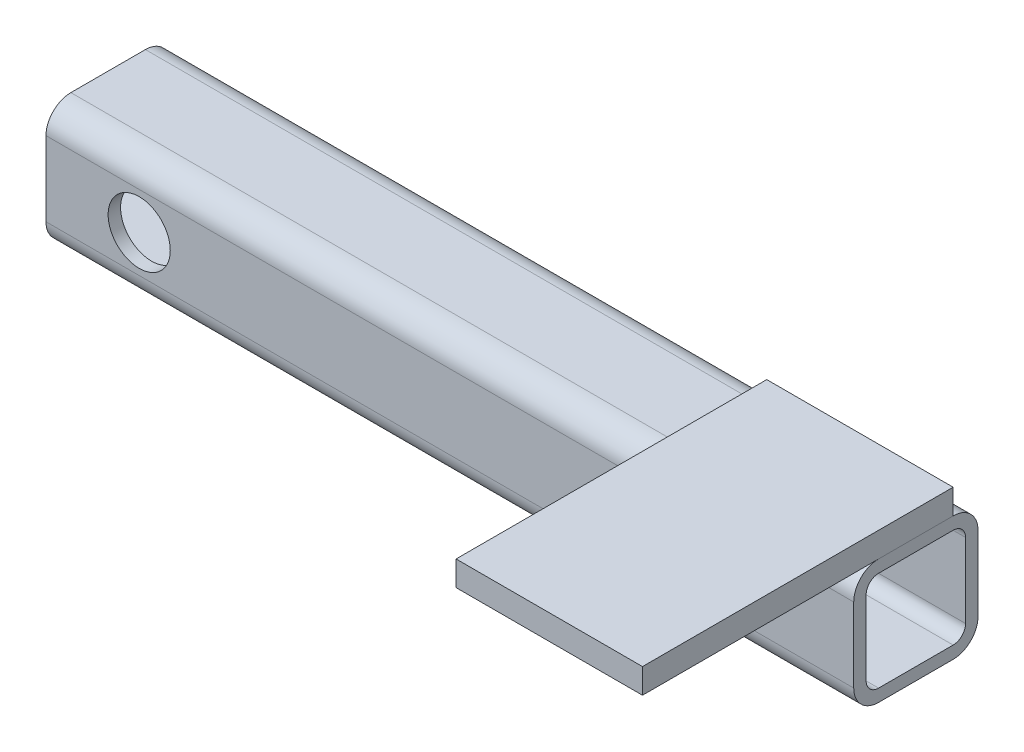
ISO-10303-21;
HEADER;
FILE_DESCRIPTION(('STEP AP214'),'2;1');
FILE_NAME('part.step','',(''),(''),'','','');
FILE_SCHEMA(('AUTOMOTIVE_DESIGN { 1 0 10303 214 1 1 1 1 }'));
ENDSEC;
DATA;
#1=APPLICATION_CONTEXT('core data for automotive mechanical design processes');
#2=APPLICATION_PROTOCOL_DEFINITION('international standard','automotive_design',2000,#1);
#3=PRODUCT_CONTEXT('',#1,'mechanical');
#4=PRODUCT('Part','Part','',(#3));
#5=PRODUCT_RELATED_PRODUCT_CATEGORY('part','',(#4));
#6=PRODUCT_DEFINITION_FORMATION('','',#4);
#7=PRODUCT_DEFINITION_CONTEXT('part definition',#1,'design');
#8=PRODUCT_DEFINITION('design','',#6,#7);
#9=PRODUCT_DEFINITION_SHAPE('','',#8);
#10=(LENGTH_UNIT() NAMED_UNIT(*) SI_UNIT(.MILLI.,.METRE.));
#11=(NAMED_UNIT(*) PLANE_ANGLE_UNIT() SI_UNIT($,.RADIAN.));
#12=(NAMED_UNIT(*) SI_UNIT($,.STERADIAN.) SOLID_ANGLE_UNIT());
#13=UNCERTAINTY_MEASURE_WITH_UNIT(LENGTH_MEASURE(1.E-05),#10,'distance_accuracy_value','');
#14=(GEOMETRIC_REPRESENTATION_CONTEXT(3) GLOBAL_UNCERTAINTY_ASSIGNED_CONTEXT((#13)) GLOBAL_UNIT_ASSIGNED_CONTEXT((#10,
#11,#12)) REPRESENTATION_CONTEXT('',''));
#15=CARTESIAN_POINT('',(0.,0.,0.));
#16=DIRECTION('',(0.,0.,1.));
#17=DIRECTION('',(1.,0.,0.));
#18=AXIS2_PLACEMENT_3D('',#15,#16,#17);
#19=CARTESIAN_POINT('',(130.,14.,-6.));
#20=DIRECTION('',(0.,0.,1.));
#21=DIRECTION('',(1.,0.,0.));
#22=AXIS2_PLACEMENT_3D('',#19,#20,#21);
#23=PLANE('',#22);
#24=DIRECTION('',(-1.,0.,0.));
#25=VECTOR('',#24,1.);
#26=CARTESIAN_POINT('',(130.,10.,-6.));
#27=LINE('',#26,#25);
#28=CARTESIAN_POINT('',(130.,10.,-6.));
#29=VERTEX_POINT('',#28);
#30=CARTESIAN_POINT('',(100.,10.,-5.99999999999999));
#31=VERTEX_POINT('',#30);
#32=EDGE_CURVE('E134',#29,#31,#27,.T.);
#33=ORIENTED_EDGE('',*,*,#32,.T.);
#34=DIRECTION('',(0.,-1.,0.));
#35=VECTOR('',#34,1.);
#36=CARTESIAN_POINT('',(100.,14.,-5.99999999999999));
#37=LINE('',#36,#35);
#38=CARTESIAN_POINT('',(100.,14.,-5.99999999999999));
#39=VERTEX_POINT('',#38);
#40=EDGE_CURVE('E13',#39,#31,#37,.T.);
#41=ORIENTED_EDGE('',*,*,#40,.F.);
#42=DIRECTION('',(-1.,0.,0.));
#43=VECTOR('',#42,1.);
#44=CARTESIAN_POINT('',(130.,14.,-6.));
#45=LINE('',#44,#43);
#46=CARTESIAN_POINT('',(130.,14.,-6.));
#47=VERTEX_POINT('',#46);
#48=EDGE_CURVE('E120',#47,#39,#45,.T.);
#49=ORIENTED_EDGE('',*,*,#48,.F.);
#50=DIRECTION('',(0.,-1.,0.));
#51=VECTOR('',#50,1.);
#52=CARTESIAN_POINT('',(130.,14.,-6.));
#53=LINE('',#52,#51);
#54=EDGE_CURVE('E87',#47,#29,#53,.T.);
#55=ORIENTED_EDGE('',*,*,#54,.T.);
#56=EDGE_LOOP('',(#33,#41,#49,#55));
#57=FACE_BOUND('',#56,.T.);
#58=ADVANCED_FACE('F71',(#57),#23,.F.);
#59=CARTESIAN_POINT('',(100.,14.,-5.99999999999999));
#60=DIRECTION('',(1.,0.,0.));
#61=DIRECTION('',(0.,0.,-1.));
#62=AXIS2_PLACEMENT_3D('',#59,#60,#61);
#63=PLANE('',#62);
#64=DIRECTION('',(0.,0.,1.));
#65=VECTOR('',#64,1.);
#66=CARTESIAN_POINT('',(100.,10.,-5.99999999999999));
#67=LINE('',#66,#65);
#68=CARTESIAN_POINT('',(100.,10.,44.));
#69=VERTEX_POINT('',#68);
#70=EDGE_CURVE('E125',#31,#69,#67,.T.);
#71=ORIENTED_EDGE('',*,*,#70,.T.);
#72=DIRECTION('',(0.,-1.,0.));
#73=VECTOR('',#72,1.);
#74=CARTESIAN_POINT('',(100.,14.,44.));
#75=LINE('',#74,#73);
#76=CARTESIAN_POINT('',(100.,14.,44.));
#77=VERTEX_POINT('',#76);
#78=EDGE_CURVE('E79',#77,#69,#75,.T.);
#79=ORIENTED_EDGE('',*,*,#78,.F.);
#80=DIRECTION('',(0.,0.,1.));
#81=VECTOR('',#80,1.);
#82=CARTESIAN_POINT('',(100.,14.,-5.99999999999999));
#83=LINE('',#82,#81);
#84=EDGE_CURVE('E112',#39,#77,#83,.T.);
#85=ORIENTED_EDGE('',*,*,#84,.F.);
#86=ORIENTED_EDGE('',*,*,#40,.T.);
#87=EDGE_LOOP('',(#71,#79,#85,#86));
#88=FACE_BOUND('',#87,.T.);
#89=ADVANCED_FACE('F124',(#88),#63,.F.);
#90=CARTESIAN_POINT('',(130.,14.,44.));
#91=DIRECTION('',(0.,0.,1.));
#92=DIRECTION('',(1.,0.,0.));
#93=AXIS2_PLACEMENT_3D('',#90,#91,#92);
#94=PLANE('',#93);
#95=DIRECTION('',(-1.,0.,0.));
#96=VECTOR('',#95,1.);
#97=CARTESIAN_POINT('',(130.,10.,44.));
#98=LINE('',#97,#96);
#99=CARTESIAN_POINT('',(130.,10.,44.));
#100=VERTEX_POINT('',#99);
#101=EDGE_CURVE('E137',#100,#69,#98,.T.);
#102=ORIENTED_EDGE('',*,*,#101,.F.);
#103=DIRECTION('',(0.,-1.,0.));
#104=VECTOR('',#103,1.);
#105=CARTESIAN_POINT('',(130.,14.,44.));
#106=LINE('',#105,#104);
#107=CARTESIAN_POINT('',(130.,14.,44.));
#108=VERTEX_POINT('',#107);
#109=EDGE_CURVE('E101',#108,#100,#106,.T.);
#110=ORIENTED_EDGE('',*,*,#109,.F.);
#111=DIRECTION('',(-1.,0.,0.));
#112=VECTOR('',#111,1.);
#113=CARTESIAN_POINT('',(130.,14.,44.));
#114=LINE('',#113,#112);
#115=EDGE_CURVE('E119',#108,#77,#114,.T.);
#116=ORIENTED_EDGE('',*,*,#115,.T.);
#117=ORIENTED_EDGE('',*,*,#78,.T.);
#118=EDGE_LOOP('',(#102,#110,#116,#117));
#119=FACE_BOUND('',#118,.T.);
#120=ADVANCED_FACE('F128',(#119),#94,.T.);
#121=CARTESIAN_POINT('',(130.,14.,-6.));
#122=DIRECTION('',(1.,0.,0.));
#123=DIRECTION('',(0.,0.,-1.));
#124=AXIS2_PLACEMENT_3D('',#121,#122,#123);
#125=PLANE('',#124);
#126=DIRECTION('',(0.,0.,1.));
#127=VECTOR('',#126,1.);
#128=CARTESIAN_POINT('',(130.,10.,-6.));
#129=LINE('',#128,#127);
#130=EDGE_CURVE('E139',#29,#100,#129,.T.);
#131=ORIENTED_EDGE('',*,*,#130,.F.);
#132=ORIENTED_EDGE('',*,*,#54,.F.);
#133=DIRECTION('',(0.,0.,1.));
#134=VECTOR('',#133,1.);
#135=CARTESIAN_POINT('',(130.,14.,-6.));
#136=LINE('',#135,#134);
#137=EDGE_CURVE('E129',#47,#108,#136,.T.);
#138=ORIENTED_EDGE('',*,*,#137,.T.);
#139=ORIENTED_EDGE('',*,*,#109,.T.);
#140=EDGE_LOOP('',(#131,#132,#138,#139));
#141=FACE_BOUND('',#140,.T.);
#142=ADVANCED_FACE('F145',(#141),#125,.T.);
#143=CARTESIAN_POINT('',(0.,14.,0.));
#144=DIRECTION('',(0.,1.,0.));
#145=DIRECTION('',(0.,0.,1.));
#146=AXIS2_PLACEMENT_3D('',#143,#144,#145);
#147=PLANE('',#146);
#148=ORIENTED_EDGE('',*,*,#48,.T.);
#149=ORIENTED_EDGE('',*,*,#84,.T.);
#150=ORIENTED_EDGE('',*,*,#115,.F.);
#151=ORIENTED_EDGE('',*,*,#137,.F.);
#152=EDGE_LOOP('',(#148,#149,#150,#151));
#153=FACE_BOUND('',#152,.T.);
#154=ADVANCED_FACE('F116',(#153),#147,.T.);
#155=CARTESIAN_POINT('',(0.,10.,0.));
#156=DIRECTION('',(0.,1.,0.));
#157=DIRECTION('',(0.,0.,1.));
#158=AXIS2_PLACEMENT_3D('',#155,#156,#157);
#159=PLANE('',#158);
#160=ORIENTED_EDGE('',*,*,#32,.F.);
#161=ORIENTED_EDGE('',*,*,#130,.T.);
#162=ORIENTED_EDGE('',*,*,#101,.T.);
#163=ORIENTED_EDGE('',*,*,#70,.F.);
#164=EDGE_LOOP('',(#160,#161,#162,#163));
#165=FACE_BOUND('',#164,.T.);
#166=ADVANCED_FACE('F144',(#165),#159,.F.);
#167=CLOSED_SHELL('',(#58,#89,#120,#142,#154,#166));
#168=MANIFOLD_SOLID_BREP('B2',#167);
#169=CARTESIAN_POINT('',(130.,6.,6.));
#170=DIRECTION('',(-1.,0.,0.));
#171=DIRECTION('',(0.,0.,1.));
#172=AXIS2_PLACEMENT_3D('',#169,#170,#171);
#173=CYLINDRICAL_SURFACE('',#172,4.);
#174=CARTESIAN_POINT('',(0.,6.,6.));
#175=DIRECTION('',(1.,0.,0.));
#176=DIRECTION('',(0.,0.,-1.));
#177=AXIS2_PLACEMENT_3D('',#174,#175,#176);
#178=CIRCLE('',#177,4.);
#179=CARTESIAN_POINT('',(0.,10.,6.));
#180=VERTEX_POINT('',#179);
#181=CARTESIAN_POINT('',(0.,6.,10.));
#182=VERTEX_POINT('',#181);
#183=EDGE_CURVE('E369',#180,#182,#178,.T.);
#184=ORIENTED_EDGE('',*,*,#183,.T.);
#185=DIRECTION('',(-1.,0.,0.));
#186=VECTOR('',#185,1.);
#187=CARTESIAN_POINT('',(130.,6.,10.));
#188=LINE('',#187,#186);
#189=CARTESIAN_POINT('',(130.,6.,10.));
#190=VERTEX_POINT('',#189);
#191=EDGE_CURVE('E69',#190,#182,#188,.T.);
#192=ORIENTED_EDGE('',*,*,#191,.F.);
#193=CARTESIAN_POINT('',(130.,6.,6.));
#194=DIRECTION('',(1.,0.,0.));
#195=DIRECTION('',(0.,0.,-1.));
#196=AXIS2_PLACEMENT_3D('',#193,#194,#195);
#197=CIRCLE('',#196,4.);
#198=CARTESIAN_POINT('',(130.,10.,6.));
#199=VERTEX_POINT('',#198);
#200=EDGE_CURVE('E448',#199,#190,#197,.T.);
#201=ORIENTED_EDGE('',*,*,#200,.F.);
#202=DIRECTION('',(-1.,0.,0.));
#203=VECTOR('',#202,1.);
#204=CARTESIAN_POINT('',(130.,10.,6.));
#205=LINE('',#204,#203);
#206=EDGE_CURVE('E384',#199,#180,#205,.T.);
#207=ORIENTED_EDGE('',*,*,#206,.T.);
#208=EDGE_LOOP('',(#184,#192,#201,#207));
#209=FACE_BOUND('',#208,.T.);
#210=ADVANCED_FACE('F195',(#209),#173,.T.);
#211=CARTESIAN_POINT('',(130.,6.,10.));
#212=DIRECTION('',(0.,0.,-1.));
#213=DIRECTION('',(-1.,0.,0.));
#214=AXIS2_PLACEMENT_3D('',#211,#212,#213);
#215=PLANE('',#214);
#216=CARTESIAN_POINT('',(15.,0.,10.));
#217=DIRECTION('',(0.,0.,1.));
#218=DIRECTION('',(1.,0.,0.));
#219=AXIS2_PLACEMENT_3D('',#216,#217,#218);
#220=CIRCLE('',#219,5.);
#221=CARTESIAN_POINT('',(20.,0.,10.));
#222=VERTEX_POINT('',#221);
#223=EDGE_CURVE('E523',#222,#222,#220,.T.);
#224=ORIENTED_EDGE('',*,*,#223,.F.);
#225=EDGE_LOOP('',(#224));
#226=FACE_BOUND('',#225,.T.);
#227=DIRECTION('',(0.,-1.,0.));
#228=VECTOR('',#227,1.);
#229=CARTESIAN_POINT('',(0.,6.,10.));
#230=LINE('',#229,#228);
#231=CARTESIAN_POINT('',(0.,-6.,10.));
#232=VERTEX_POINT('',#231);
#233=EDGE_CURVE('E372',#182,#232,#230,.T.);
#234=ORIENTED_EDGE('',*,*,#233,.T.);
#235=DIRECTION('',(-1.,0.,0.));
#236=VECTOR('',#235,1.);
#237=CARTESIAN_POINT('',(130.,-6.,10.));
#238=LINE('',#237,#236);
#239=CARTESIAN_POINT('',(130.,-6.,10.));
#240=VERTEX_POINT('',#239);
#241=EDGE_CURVE('E205',#240,#232,#238,.T.);
#242=ORIENTED_EDGE('',*,*,#241,.F.);
#243=DIRECTION('',(0.,-1.,0.));
#244=VECTOR('',#243,1.);
#245=CARTESIAN_POINT('',(130.,6.,10.));
#246=LINE('',#245,#244);
#247=EDGE_CURVE('E450',#190,#240,#246,.T.);
#248=ORIENTED_EDGE('',*,*,#247,.F.);
#249=ORIENTED_EDGE('',*,*,#191,.T.);
#250=EDGE_LOOP('',(#234,#242,#248,#249));
#251=FACE_BOUND('',#250,.T.);
#252=ADVANCED_FACE('F485',(#226,#251),#215,.F.);
#253=CARTESIAN_POINT('',(130.,-6.,6.));
#254=DIRECTION('',(-1.,0.,0.));
#255=DIRECTION('',(0.,0.,1.));
#256=AXIS2_PLACEMENT_3D('',#253,#254,#255);
#257=CYLINDRICAL_SURFACE('',#256,4.);
#258=CARTESIAN_POINT('',(0.,-6.,6.));
#259=DIRECTION('',(1.,0.,0.));
#260=DIRECTION('',(0.,0.,-1.));
#261=AXIS2_PLACEMENT_3D('',#258,#259,#260);
#262=CIRCLE('',#261,4.);
#263=CARTESIAN_POINT('',(0.,-10.,6.));
#264=VERTEX_POINT('',#263);
#265=EDGE_CURVE('E374',#232,#264,#262,.T.);
#266=ORIENTED_EDGE('',*,*,#265,.T.);
#267=DIRECTION('',(-1.,0.,0.));
#268=VECTOR('',#267,1.);
#269=CARTESIAN_POINT('',(130.,-10.,6.));
#270=LINE('',#269,#268);
#271=CARTESIAN_POINT('',(130.,-10.,6.));
#272=VERTEX_POINT('',#271);
#273=EDGE_CURVE('E391',#272,#264,#270,.T.);
#274=ORIENTED_EDGE('',*,*,#273,.F.);
#275=CARTESIAN_POINT('',(130.,-6.,6.));
#276=DIRECTION('',(1.,0.,0.));
#277=DIRECTION('',(0.,0.,-1.));
#278=AXIS2_PLACEMENT_3D('',#275,#276,#277);
#279=CIRCLE('',#278,4.);
#280=EDGE_CURVE('E452',#240,#272,#279,.T.);
#281=ORIENTED_EDGE('',*,*,#280,.F.);
#282=ORIENTED_EDGE('',*,*,#241,.T.);
#283=EDGE_LOOP('',(#266,#274,#281,#282));
#284=FACE_BOUND('',#283,.T.);
#285=ADVANCED_FACE('F490',(#284),#257,.T.);
#286=CARTESIAN_POINT('',(130.,-10.,-6.));
#287=DIRECTION('',(0.,1.,0.));
#288=DIRECTION('',(0.,0.,1.));
#289=AXIS2_PLACEMENT_3D('',#286,#287,#288);
#290=PLANE('',#289);
#291=DIRECTION('',(0.,0.,-1.));
#292=VECTOR('',#291,1.);
#293=CARTESIAN_POINT('',(0.,-10.,-6.));
#294=LINE('',#293,#292);
#295=CARTESIAN_POINT('',(0.,-10.,-6.));
#296=VERTEX_POINT('',#295);
#297=EDGE_CURVE('E376',#264,#296,#294,.T.);
#298=ORIENTED_EDGE('',*,*,#297,.T.);
#299=DIRECTION('',(-1.,0.,0.));
#300=VECTOR('',#299,1.);
#301=CARTESIAN_POINT('',(130.,-10.,-6.));
#302=LINE('',#301,#300);
#303=CARTESIAN_POINT('',(130.,-10.,-6.));
#304=VERTEX_POINT('',#303);
#305=EDGE_CURVE('E388',#304,#296,#302,.T.);
#306=ORIENTED_EDGE('',*,*,#305,.F.);
#307=DIRECTION('',(0.,0.,-1.));
#308=VECTOR('',#307,1.);
#309=CARTESIAN_POINT('',(130.,-10.,-6.));
#310=LINE('',#309,#308);
#311=EDGE_CURVE('E454',#272,#304,#310,.T.);
#312=ORIENTED_EDGE('',*,*,#311,.F.);
#313=ORIENTED_EDGE('',*,*,#273,.T.);
#314=EDGE_LOOP('',(#298,#306,#312,#313));
#315=FACE_BOUND('',#314,.T.);
#316=ADVANCED_FACE('F460',(#315),#290,.F.);
#317=CARTESIAN_POINT('',(130.,-6.,-6.));
#318=DIRECTION('',(-1.,0.,0.));
#319=DIRECTION('',(0.,0.,1.));
#320=AXIS2_PLACEMENT_3D('',#317,#318,#319);
#321=CYLINDRICAL_SURFACE('',#320,4.);
#322=CARTESIAN_POINT('',(0.,-6.,-6.));
#323=DIRECTION('',(1.,0.,0.));
#324=DIRECTION('',(0.,0.,-1.));
#325=AXIS2_PLACEMENT_3D('',#322,#323,#324);
#326=CIRCLE('',#325,4.);
#327=CARTESIAN_POINT('',(0.,-6.,-10.));
#328=VERTEX_POINT('',#327);
#329=EDGE_CURVE('E378',#296,#328,#326,.T.);
#330=ORIENTED_EDGE('',*,*,#329,.T.);
#331=DIRECTION('',(-1.,0.,0.));
#332=VECTOR('',#331,1.);
#333=CARTESIAN_POINT('',(130.,-6.,-10.));
#334=LINE('',#333,#332);
#335=CARTESIAN_POINT('',(130.,-6.,-10.));
#336=VERTEX_POINT('',#335);
#337=EDGE_CURVE('E335',#336,#328,#334,.T.);
#338=ORIENTED_EDGE('',*,*,#337,.F.);
#339=CARTESIAN_POINT('',(130.,-6.,-6.));
#340=DIRECTION('',(1.,0.,0.));
#341=DIRECTION('',(0.,0.,-1.));
#342=AXIS2_PLACEMENT_3D('',#339,#340,#341);
#343=CIRCLE('',#342,4.);
#344=EDGE_CURVE('E326',#304,#336,#343,.T.);
#345=ORIENTED_EDGE('',*,*,#344,.F.);
#346=ORIENTED_EDGE('',*,*,#305,.T.);
#347=EDGE_LOOP('',(#330,#338,#345,#346));
#348=FACE_BOUND('',#347,.T.);
#349=ADVANCED_FACE('F464',(#348),#321,.T.);
#350=CARTESIAN_POINT('',(130.,-6.,-10.));
#351=DIRECTION('',(0.,0.,1.));
#352=DIRECTION('',(1.,0.,0.));
#353=AXIS2_PLACEMENT_3D('',#350,#351,#352);
#354=PLANE('',#353);
#355=CARTESIAN_POINT('',(15.,0.,-10.));
#356=DIRECTION('',(0.,0.,1.));
#357=DIRECTION('',(1.,0.,0.));
#358=AXIS2_PLACEMENT_3D('',#355,#356,#357);
#359=CIRCLE('',#358,5.);
#360=CARTESIAN_POINT('',(20.,0.,-10.));
#361=VERTEX_POINT('',#360);
#362=EDGE_CURVE('E348',#361,#361,#359,.T.);
#363=ORIENTED_EDGE('',*,*,#362,.T.);
#364=EDGE_LOOP('',(#363));
#365=FACE_BOUND('',#364,.T.);
#366=DIRECTION('',(0.,1.,0.));
#367=VECTOR('',#366,1.);
#368=CARTESIAN_POINT('',(0.,-6.,-10.));
#369=LINE('',#368,#367);
#370=CARTESIAN_POINT('',(0.,6.,-10.));
#371=VERTEX_POINT('',#370);
#372=EDGE_CURVE('E334',#328,#371,#369,.T.);
#373=ORIENTED_EDGE('',*,*,#372,.T.);
#374=DIRECTION('',(-1.,0.,0.));
#375=VECTOR('',#374,1.);
#376=CARTESIAN_POINT('',(130.,6.,-10.));
#377=LINE('',#376,#375);
#378=CARTESIAN_POINT('',(130.,6.,-10.));
#379=VERTEX_POINT('',#378);
#380=EDGE_CURVE('E331',#379,#371,#377,.T.);
#381=ORIENTED_EDGE('',*,*,#380,.F.);
#382=DIRECTION('',(0.,1.,0.));
#383=VECTOR('',#382,1.);
#384=CARTESIAN_POINT('',(130.,-6.,-10.));
#385=LINE('',#384,#383);
#386=EDGE_CURVE('E320',#336,#379,#385,.T.);
#387=ORIENTED_EDGE('',*,*,#386,.F.);
#388=ORIENTED_EDGE('',*,*,#337,.T.);
#389=EDGE_LOOP('',(#373,#381,#387,#388));
#390=FACE_BOUND('',#389,.T.);
#391=ADVANCED_FACE('F332',(#365,#390),#354,.F.);
#392=CARTESIAN_POINT('',(130.,6.,-6.));
#393=DIRECTION('',(-1.,0.,0.));
#394=DIRECTION('',(0.,0.,1.));
#395=AXIS2_PLACEMENT_3D('',#392,#393,#394);
#396=CYLINDRICAL_SURFACE('',#395,4.);
#397=CARTESIAN_POINT('',(0.,6.,-6.));
#398=DIRECTION('',(1.,0.,0.));
#399=DIRECTION('',(0.,0.,-1.));
#400=AXIS2_PLACEMENT_3D('',#397,#398,#399);
#401=CIRCLE('',#400,4.);
#402=CARTESIAN_POINT('',(0.,10.,-6.));
#403=VERTEX_POINT('',#402);
#404=EDGE_CURVE('E267',#371,#403,#401,.T.);
#405=ORIENTED_EDGE('',*,*,#404,.T.);
#406=DIRECTION('',(-1.,0.,0.));
#407=VECTOR('',#406,1.);
#408=CARTESIAN_POINT('',(130.,10.,-6.));
#409=LINE('',#408,#407);
#410=CARTESIAN_POINT('',(130.,10.,-6.));
#411=VERTEX_POINT('',#410);
#412=EDGE_CURVE('E336',#411,#403,#409,.T.);
#413=ORIENTED_EDGE('',*,*,#412,.F.);
#414=CARTESIAN_POINT('',(130.,6.,-6.));
#415=DIRECTION('',(1.,0.,0.));
#416=DIRECTION('',(0.,0.,-1.));
#417=AXIS2_PLACEMENT_3D('',#414,#415,#416);
#418=CIRCLE('',#417,4.);
#419=EDGE_CURVE('E324',#379,#411,#418,.T.);
#420=ORIENTED_EDGE('',*,*,#419,.F.);
#421=ORIENTED_EDGE('',*,*,#380,.T.);
#422=EDGE_LOOP('',(#405,#413,#420,#421));
#423=FACE_BOUND('',#422,.T.);
#424=ADVANCED_FACE('F338',(#423),#396,.T.);
#425=CARTESIAN_POINT('',(130.,-6.,6.));
#426=DIRECTION('',(-1.,0.,0.));
#427=DIRECTION('',(0.,0.,1.));
#428=AXIS2_PLACEMENT_3D('',#425,#426,#427);
#429=CYLINDRICAL_SURFACE('',#428,2.);
#430=CARTESIAN_POINT('',(0.,-6.,6.));
#431=DIRECTION('',(1.,0.,0.));
#432=DIRECTION('',(0.,0.,-1.));
#433=AXIS2_PLACEMENT_3D('',#430,#431,#432);
#434=CIRCLE('',#433,2.);
#435=CARTESIAN_POINT('',(0.,-6.,8.));
#436=VERTEX_POINT('',#435);
#437=CARTESIAN_POINT('',(0.,-8.,6.));
#438=VERTEX_POINT('',#437);
#439=EDGE_CURVE('E344',#436,#438,#434,.T.);
#440=ORIENTED_EDGE('',*,*,#439,.F.);
#441=DIRECTION('',(-1.,0.,0.));
#442=VECTOR('',#441,1.);
#443=CARTESIAN_POINT('',(130.,-6.,8.));
#444=LINE('',#443,#442);
#445=CARTESIAN_POINT('',(130.,-6.,8.));
#446=VERTEX_POINT('',#445);
#447=EDGE_CURVE('E281',#446,#436,#444,.T.);
#448=ORIENTED_EDGE('',*,*,#447,.F.);
#449=CARTESIAN_POINT('',(130.,-6.,6.));
#450=DIRECTION('',(1.,0.,0.));
#451=DIRECTION('',(0.,0.,-1.));
#452=AXIS2_PLACEMENT_3D('',#449,#450,#451);
#453=CIRCLE('',#452,2.);
#454=CARTESIAN_POINT('',(130.,-8.,6.));
#455=VERTEX_POINT('',#454);
#456=EDGE_CURVE('E383',#446,#455,#453,.T.);
#457=ORIENTED_EDGE('',*,*,#456,.T.);
#458=DIRECTION('',(-1.,0.,0.));
#459=VECTOR('',#458,1.);
#460=CARTESIAN_POINT('',(130.,-8.,6.));
#461=LINE('',#460,#459);
#462=EDGE_CURVE('E340',#455,#438,#461,.T.);
#463=ORIENTED_EDGE('',*,*,#462,.T.);
#464=EDGE_LOOP('',(#440,#448,#457,#463));
#465=FACE_BOUND('',#464,.T.);
#466=ADVANCED_FACE('F197',(#465),#429,.F.);
#467=CARTESIAN_POINT('',(130.,6.,8.));
#468=DIRECTION('',(0.,0.,-1.));
#469=DIRECTION('',(-1.,0.,0.));
#470=AXIS2_PLACEMENT_3D('',#467,#468,#469);
#471=PLANE('',#470);
#472=CARTESIAN_POINT('',(15.,0.,8.));
#473=DIRECTION('',(0.,0.,-1.));
#474=DIRECTION('',(-1.,0.,0.));
#475=AXIS2_PLACEMENT_3D('',#472,#473,#474);
#476=CIRCLE('',#475,5.);
#477=CARTESIAN_POINT('',(10.,0.,8.));
#478=VERTEX_POINT('',#477);
#479=EDGE_CURVE('E518',#478,#478,#476,.T.);
#480=ORIENTED_EDGE('',*,*,#479,.F.);
#481=EDGE_LOOP('',(#480));
#482=FACE_BOUND('',#481,.T.);
#483=DIRECTION('',(0.,-1.,0.));
#484=VECTOR('',#483,1.);
#485=CARTESIAN_POINT('',(0.,6.,8.));
#486=LINE('',#485,#484);
#487=CARTESIAN_POINT('',(0.,6.,8.));
#488=VERTEX_POINT('',#487);
#489=EDGE_CURVE('E347',#488,#436,#486,.T.);
#490=ORIENTED_EDGE('',*,*,#489,.F.);
#491=DIRECTION('',(-1.,0.,0.));
#492=VECTOR('',#491,1.);
#493=CARTESIAN_POINT('',(130.,6.,8.));
#494=LINE('',#493,#492);
#495=CARTESIAN_POINT('',(130.,6.,8.));
#496=VERTEX_POINT('',#495);
#497=EDGE_CURVE('E407',#496,#488,#494,.T.);
#498=ORIENTED_EDGE('',*,*,#497,.F.);
#499=DIRECTION('',(0.,-1.,0.));
#500=VECTOR('',#499,1.);
#501=CARTESIAN_POINT('',(130.,6.,8.));
#502=LINE('',#501,#500);
#503=EDGE_CURVE('E413',#496,#446,#502,.T.);
#504=ORIENTED_EDGE('',*,*,#503,.T.);
#505=ORIENTED_EDGE('',*,*,#447,.T.);
#506=EDGE_LOOP('',(#490,#498,#504,#505));
#507=FACE_BOUND('',#506,.T.);
#508=ADVANCED_FACE('F411',(#482,#507),#471,.T.);
#509=CARTESIAN_POINT('',(130.,6.,6.));
#510=DIRECTION('',(-1.,0.,0.));
#511=DIRECTION('',(0.,0.,1.));
#512=AXIS2_PLACEMENT_3D('',#509,#510,#511);
#513=CYLINDRICAL_SURFACE('',#512,2.);
#514=CARTESIAN_POINT('',(0.,6.,6.));
#515=DIRECTION('',(1.,0.,0.));
#516=DIRECTION('',(0.,0.,-1.));
#517=AXIS2_PLACEMENT_3D('',#514,#515,#516);
#518=CIRCLE('',#517,2.);
#519=CARTESIAN_POINT('',(0.,8.,6.));
#520=VERTEX_POINT('',#519);
#521=EDGE_CURVE('E351',#520,#488,#518,.T.);
#522=ORIENTED_EDGE('',*,*,#521,.F.);
#523=DIRECTION('',(-1.,0.,0.));
#524=VECTOR('',#523,1.);
#525=CARTESIAN_POINT('',(130.,8.,6.));
#526=LINE('',#525,#524);
#527=CARTESIAN_POINT('',(130.,8.,6.));
#528=VERTEX_POINT('',#527);
#529=EDGE_CURVE('E405',#528,#520,#526,.T.);
#530=ORIENTED_EDGE('',*,*,#529,.F.);
#531=CARTESIAN_POINT('',(130.,6.,6.));
#532=DIRECTION('',(1.,0.,0.));
#533=DIRECTION('',(0.,0.,-1.));
#534=AXIS2_PLACEMENT_3D('',#531,#532,#533);
#535=CIRCLE('',#534,2.);
#536=EDGE_CURVE('E424',#528,#496,#535,.T.);
#537=ORIENTED_EDGE('',*,*,#536,.T.);
#538=ORIENTED_EDGE('',*,*,#497,.T.);
#539=EDGE_LOOP('',(#522,#530,#537,#538));
#540=FACE_BOUND('',#539,.T.);
#541=ADVANCED_FACE('F421',(#540),#513,.F.);
#542=CARTESIAN_POINT('',(130.,8.,6.));
#543=DIRECTION('',(0.,-1.,0.));
#544=DIRECTION('',(0.,0.,-1.));
#545=AXIS2_PLACEMENT_3D('',#542,#543,#544);
#546=PLANE('',#545);
#547=DIRECTION('',(0.,0.,1.));
#548=VECTOR('',#547,1.);
#549=CARTESIAN_POINT('',(0.,8.,6.));
#550=LINE('',#549,#548);
#551=CARTESIAN_POINT('',(0.,8.,-6.));
#552=VERTEX_POINT('',#551);
#553=EDGE_CURVE('E354',#552,#520,#550,.T.);
#554=ORIENTED_EDGE('',*,*,#553,.F.);
#555=DIRECTION('',(-1.,0.,0.));
#556=VECTOR('',#555,1.);
#557=CARTESIAN_POINT('',(130.,8.,-6.));
#558=LINE('',#557,#556);
#559=CARTESIAN_POINT('',(130.,8.,-6.));
#560=VERTEX_POINT('',#559);
#561=EDGE_CURVE('E403',#560,#552,#558,.T.);
#562=ORIENTED_EDGE('',*,*,#561,.F.);
#563=DIRECTION('',(0.,0.,1.));
#564=VECTOR('',#563,1.);
#565=CARTESIAN_POINT('',(130.,8.,6.));
#566=LINE('',#565,#564);
#567=EDGE_CURVE('E430',#560,#528,#566,.T.);
#568=ORIENTED_EDGE('',*,*,#567,.T.);
#569=ORIENTED_EDGE('',*,*,#529,.T.);
#570=EDGE_LOOP('',(#554,#562,#568,#569));
#571=FACE_BOUND('',#570,.T.);
#572=ADVANCED_FACE('F505',(#571),#546,.T.);
#573=CARTESIAN_POINT('',(130.,6.,-6.));
#574=DIRECTION('',(-1.,0.,0.));
#575=DIRECTION('',(0.,0.,1.));
#576=AXIS2_PLACEMENT_3D('',#573,#574,#575);
#577=CYLINDRICAL_SURFACE('',#576,2.);
#578=CARTESIAN_POINT('',(0.,6.,-6.));
#579=DIRECTION('',(1.,0.,0.));
#580=DIRECTION('',(0.,0.,-1.));
#581=AXIS2_PLACEMENT_3D('',#578,#579,#580);
#582=CIRCLE('',#581,2.);
#583=CARTESIAN_POINT('',(0.,6.,-8.));
#584=VERTEX_POINT('',#583);
#585=EDGE_CURVE('E357',#584,#552,#582,.T.);
#586=ORIENTED_EDGE('',*,*,#585,.F.);
#587=DIRECTION('',(-1.,0.,0.));
#588=VECTOR('',#587,1.);
#589=CARTESIAN_POINT('',(130.,6.,-8.));
#590=LINE('',#589,#588);
#591=CARTESIAN_POINT('',(130.,6.,-8.));
#592=VERTEX_POINT('',#591);
#593=EDGE_CURVE('E401',#592,#584,#590,.T.);
#594=ORIENTED_EDGE('',*,*,#593,.F.);
#595=CARTESIAN_POINT('',(130.,6.,-6.));
#596=DIRECTION('',(1.,0.,0.));
#597=DIRECTION('',(0.,0.,-1.));
#598=AXIS2_PLACEMENT_3D('',#595,#596,#597);
#599=CIRCLE('',#598,2.);
#600=EDGE_CURVE('E436',#592,#560,#599,.T.);
#601=ORIENTED_EDGE('',*,*,#600,.T.);
#602=ORIENTED_EDGE('',*,*,#561,.T.);
#603=EDGE_LOOP('',(#586,#594,#601,#602));
#604=FACE_BOUND('',#603,.T.);
#605=ADVANCED_FACE('F501',(#604),#577,.F.);
#606=CARTESIAN_POINT('',(130.,-6.,-8.));
#607=DIRECTION('',(0.,0.,1.));
#608=DIRECTION('',(1.,0.,0.));
#609=AXIS2_PLACEMENT_3D('',#606,#607,#608);
#610=PLANE('',#609);
#611=CARTESIAN_POINT('',(15.,0.,-8.));
#612=DIRECTION('',(0.,0.,1.));
#613=DIRECTION('',(1.,0.,0.));
#614=AXIS2_PLACEMENT_3D('',#611,#612,#613);
#615=CIRCLE('',#614,5.);
#616=CARTESIAN_POINT('',(20.,0.,-8.));
#617=VERTEX_POINT('',#616);
#618=EDGE_CURVE('E199',#617,#617,#615,.T.);
#619=ORIENTED_EDGE('',*,*,#618,.F.);
#620=EDGE_LOOP('',(#619));
#621=FACE_BOUND('',#620,.T.);
#622=DIRECTION('',(0.,1.,0.));
#623=VECTOR('',#622,1.);
#624=CARTESIAN_POINT('',(0.,-6.,-8.));
#625=LINE('',#624,#623);
#626=CARTESIAN_POINT('',(0.,-6.,-8.));
#627=VERTEX_POINT('',#626);
#628=EDGE_CURVE('E360',#627,#584,#625,.T.);
#629=ORIENTED_EDGE('',*,*,#628,.F.);
#630=DIRECTION('',(-1.,0.,0.));
#631=VECTOR('',#630,1.);
#632=CARTESIAN_POINT('',(130.,-6.,-8.));
#633=LINE('',#632,#631);
#634=CARTESIAN_POINT('',(130.,-6.,-8.));
#635=VERTEX_POINT('',#634);
#636=EDGE_CURVE('E399',#635,#627,#633,.T.);
#637=ORIENTED_EDGE('',*,*,#636,.F.);
#638=DIRECTION('',(0.,1.,0.));
#639=VECTOR('',#638,1.);
#640=CARTESIAN_POINT('',(130.,-6.,-8.));
#641=LINE('',#640,#639);
#642=EDGE_CURVE('E439',#635,#592,#641,.T.);
#643=ORIENTED_EDGE('',*,*,#642,.T.);
#644=ORIENTED_EDGE('',*,*,#593,.T.);
#645=EDGE_LOOP('',(#629,#637,#643,#644));
#646=FACE_BOUND('',#645,.T.);
#647=ADVANCED_FACE('F497',(#621,#646),#610,.T.);
#648=CARTESIAN_POINT('',(130.,-6.,-6.));
#649=DIRECTION('',(-1.,0.,0.));
#650=DIRECTION('',(0.,0.,1.));
#651=AXIS2_PLACEMENT_3D('',#648,#649,#650);
#652=CYLINDRICAL_SURFACE('',#651,2.);
#653=CARTESIAN_POINT('',(0.,-6.,-6.));
#654=DIRECTION('',(1.,0.,0.));
#655=DIRECTION('',(0.,0.,-1.));
#656=AXIS2_PLACEMENT_3D('',#653,#654,#655);
#657=CIRCLE('',#656,2.);
#658=CARTESIAN_POINT('',(0.,-8.,-6.));
#659=VERTEX_POINT('',#658);
#660=EDGE_CURVE('E363',#659,#627,#657,.T.);
#661=ORIENTED_EDGE('',*,*,#660,.F.);
#662=DIRECTION('',(-1.,0.,0.));
#663=VECTOR('',#662,1.);
#664=CARTESIAN_POINT('',(130.,-8.,-6.));
#665=LINE('',#664,#663);
#666=CARTESIAN_POINT('',(130.,-8.,-6.));
#667=VERTEX_POINT('',#666);
#668=EDGE_CURVE('E397',#667,#659,#665,.T.);
#669=ORIENTED_EDGE('',*,*,#668,.F.);
#670=CARTESIAN_POINT('',(130.,-6.,-6.));
#671=DIRECTION('',(1.,0.,0.));
#672=DIRECTION('',(0.,0.,-1.));
#673=AXIS2_PLACEMENT_3D('',#670,#671,#672);
#674=CIRCLE('',#673,2.);
#675=EDGE_CURVE('E442',#667,#635,#674,.T.);
#676=ORIENTED_EDGE('',*,*,#675,.T.);
#677=ORIENTED_EDGE('',*,*,#636,.T.);
#678=EDGE_LOOP('',(#661,#669,#676,#677));
#679=FACE_BOUND('',#678,.T.);
#680=ADVANCED_FACE('F479',(#679),#652,.F.);
#681=CARTESIAN_POINT('',(130.,-8.,-6.));
#682=DIRECTION('',(0.,1.,0.));
#683=DIRECTION('',(0.,0.,1.));
#684=AXIS2_PLACEMENT_3D('',#681,#682,#683);
#685=PLANE('',#684);
#686=DIRECTION('',(0.,0.,-1.));
#687=VECTOR('',#686,1.);
#688=CARTESIAN_POINT('',(0.,-8.,-6.));
#689=LINE('',#688,#687);
#690=EDGE_CURVE('E366',#438,#659,#689,.T.);
#691=ORIENTED_EDGE('',*,*,#690,.F.);
#692=ORIENTED_EDGE('',*,*,#462,.F.);
#693=DIRECTION('',(0.,0.,-1.));
#694=VECTOR('',#693,1.);
#695=CARTESIAN_POINT('',(130.,-8.,-6.));
#696=LINE('',#695,#694);
#697=EDGE_CURVE('E445',#455,#667,#696,.T.);
#698=ORIENTED_EDGE('',*,*,#697,.T.);
#699=ORIENTED_EDGE('',*,*,#668,.T.);
#700=EDGE_LOOP('',(#691,#692,#698,#699));
#701=FACE_BOUND('',#700,.T.);
#702=ADVANCED_FACE('F472',(#701),#685,.T.);
#703=CARTESIAN_POINT('',(130.,10.,6.));
#704=DIRECTION('',(0.,-1.,0.));
#705=DIRECTION('',(0.,0.,-1.));
#706=AXIS2_PLACEMENT_3D('',#703,#704,#705);
#707=PLANE('',#706);
#708=DIRECTION('',(0.,0.,1.));
#709=VECTOR('',#708,1.);
#710=CARTESIAN_POINT('',(0.,10.,6.));
#711=LINE('',#710,#709);
#712=EDGE_CURVE('E273',#403,#180,#711,.T.);
#713=ORIENTED_EDGE('',*,*,#712,.T.);
#714=ORIENTED_EDGE('',*,*,#206,.F.);
#715=DIRECTION('',(0.,0.,1.));
#716=VECTOR('',#715,1.);
#717=CARTESIAN_POINT('',(130.,10.,6.));
#718=LINE('',#717,#716);
#719=EDGE_CURVE('E214',#411,#199,#718,.T.);
#720=ORIENTED_EDGE('',*,*,#719,.F.);
#721=ORIENTED_EDGE('',*,*,#412,.T.);
#722=EDGE_LOOP('',(#713,#714,#720,#721));
#723=FACE_BOUND('',#722,.T.);
#724=ADVANCED_FACE('F470',(#723),#707,.F.);
#725=CARTESIAN_POINT('',(130.,6.,6.));
#726=DIRECTION('',(1.,0.,0.));
#727=DIRECTION('',(0.,0.,-1.));
#728=AXIS2_PLACEMENT_3D('',#725,#726,#727);
#729=PLANE('',#728);
#730=ORIENTED_EDGE('',*,*,#456,.F.);
#731=ORIENTED_EDGE('',*,*,#503,.F.);
#732=ORIENTED_EDGE('',*,*,#536,.F.);
#733=ORIENTED_EDGE('',*,*,#567,.F.);
#734=ORIENTED_EDGE('',*,*,#600,.F.);
#735=ORIENTED_EDGE('',*,*,#642,.F.);
#736=ORIENTED_EDGE('',*,*,#675,.F.);
#737=ORIENTED_EDGE('',*,*,#697,.F.);
#738=EDGE_LOOP('',(#730,#731,#732,#733,#734,#735,#736,#737));
#739=FACE_BOUND('',#738,.T.);
#740=ORIENTED_EDGE('',*,*,#200,.T.);
#741=ORIENTED_EDGE('',*,*,#247,.T.);
#742=ORIENTED_EDGE('',*,*,#280,.T.);
#743=ORIENTED_EDGE('',*,*,#311,.T.);
#744=ORIENTED_EDGE('',*,*,#344,.T.);
#745=ORIENTED_EDGE('',*,*,#386,.T.);
#746=ORIENTED_EDGE('',*,*,#419,.T.);
#747=ORIENTED_EDGE('',*,*,#719,.T.);
#748=EDGE_LOOP('',(#740,#741,#742,#743,#744,#745,#746,#747));
#749=FACE_BOUND('',#748,.T.);
#750=ADVANCED_FACE('F322',(#739,#749),#729,.T.);
#751=CARTESIAN_POINT('',(0.,6.,6.));
#752=DIRECTION('',(1.,0.,0.));
#753=DIRECTION('',(0.,0.,-1.));
#754=AXIS2_PLACEMENT_3D('',#751,#752,#753);
#755=PLANE('',#754);
#756=ORIENTED_EDGE('',*,*,#439,.T.);
#757=ORIENTED_EDGE('',*,*,#690,.T.);
#758=ORIENTED_EDGE('',*,*,#660,.T.);
#759=ORIENTED_EDGE('',*,*,#628,.T.);
#760=ORIENTED_EDGE('',*,*,#585,.T.);
#761=ORIENTED_EDGE('',*,*,#553,.T.);
#762=ORIENTED_EDGE('',*,*,#521,.T.);
#763=ORIENTED_EDGE('',*,*,#489,.T.);
#764=EDGE_LOOP('',(#756,#757,#758,#759,#760,#761,#762,#763));
#765=FACE_BOUND('',#764,.T.);
#766=ORIENTED_EDGE('',*,*,#183,.F.);
#767=ORIENTED_EDGE('',*,*,#712,.F.);
#768=ORIENTED_EDGE('',*,*,#404,.F.);
#769=ORIENTED_EDGE('',*,*,#372,.F.);
#770=ORIENTED_EDGE('',*,*,#329,.F.);
#771=ORIENTED_EDGE('',*,*,#297,.F.);
#772=ORIENTED_EDGE('',*,*,#265,.F.);
#773=ORIENTED_EDGE('',*,*,#233,.F.);
#774=EDGE_LOOP('',(#766,#767,#768,#769,#770,#771,#772,#773));
#775=FACE_BOUND('',#774,.T.);
#776=ADVANCED_FACE('F416',(#765,#775),#755,.F.);
#777=CARTESIAN_POINT('',(15.,0.,-25.));
#778=DIRECTION('',(0.,0.,1.));
#779=DIRECTION('',(1.,0.,0.));
#780=AXIS2_PLACEMENT_3D('',#777,#778,#779);
#781=CYLINDRICAL_SURFACE('',#780,5.);
#782=ORIENTED_EDGE('',*,*,#618,.T.);
#783=EDGE_LOOP('',(#782));
#784=FACE_BOUND('',#783,.T.);
#785=ORIENTED_EDGE('',*,*,#362,.F.);
#786=EDGE_LOOP('',(#785));
#787=FACE_BOUND('',#786,.T.);
#788=ADVANCED_FACE('F611',(#784,#787),#781,.F.);
#789=ORIENTED_EDGE('',*,*,#479,.T.);
#790=EDGE_LOOP('',(#789));
#791=FACE_BOUND('',#790,.T.);
#792=ORIENTED_EDGE('',*,*,#223,.T.);
#793=EDGE_LOOP('',(#792));
#794=FACE_BOUND('',#793,.T.);
#795=ADVANCED_FACE('F528',(#791,#794),#781,.F.);
#796=CLOSED_SHELL('',(#210,#252,#285,#316,#349,#391,#424,#466,#508,#541,#572,#605,#647,#680,
#702,#724,#750,#776,#788,#795));
#797=MANIFOLD_SOLID_BREP('B7',#796);
#798=ADVANCED_BREP_SHAPE_REPRESENTATION('',(#18,#168,#797),#14);
#799=SHAPE_DEFINITION_REPRESENTATION(#9,#798);
ENDSEC;
END-ISO-10303-21;
